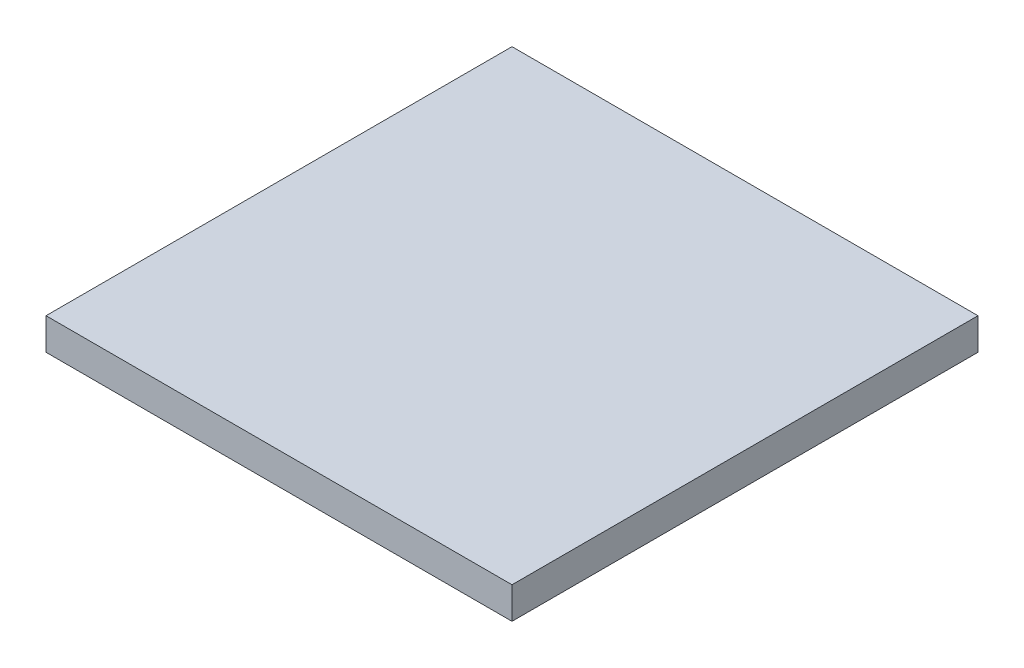
ISO-10303-21;
HEADER;
FILE_DESCRIPTION(('STEP AP214'),'2;1');
FILE_NAME('part.step','',(''),(''),'','','');
FILE_SCHEMA(('AUTOMOTIVE_DESIGN { 1 0 10303 214 1 1 1 1 }'));
ENDSEC;
DATA;
#1=APPLICATION_CONTEXT('core data for automotive mechanical design processes');
#2=APPLICATION_PROTOCOL_DEFINITION('international standard','automotive_design',2000,#1);
#3=PRODUCT_CONTEXT('',#1,'mechanical');
#4=PRODUCT('Part','Part','',(#3));
#5=PRODUCT_RELATED_PRODUCT_CATEGORY('part','',(#4));
#6=PRODUCT_DEFINITION_FORMATION('','',#4);
#7=PRODUCT_DEFINITION_CONTEXT('part definition',#1,'design');
#8=PRODUCT_DEFINITION('design','',#6,#7);
#9=PRODUCT_DEFINITION_SHAPE('','',#8);
#10=(LENGTH_UNIT() NAMED_UNIT(*) SI_UNIT(.MILLI.,.METRE.));
#11=(NAMED_UNIT(*) PLANE_ANGLE_UNIT() SI_UNIT($,.RADIAN.));
#12=(NAMED_UNIT(*) SI_UNIT($,.STERADIAN.) SOLID_ANGLE_UNIT());
#13=UNCERTAINTY_MEASURE_WITH_UNIT(LENGTH_MEASURE(1.E-05),#10,'distance_accuracy_value','');
#14=(GEOMETRIC_REPRESENTATION_CONTEXT(3) GLOBAL_UNCERTAINTY_ASSIGNED_CONTEXT((#13)) GLOBAL_UNIT_ASSIGNED_CONTEXT((#10,
#11,#12)) REPRESENTATION_CONTEXT('',''));
#15=CARTESIAN_POINT('',(0.,0.,0.));
#16=DIRECTION('',(0.,0.,1.));
#17=DIRECTION('',(1.,0.,0.));
#18=AXIS2_PLACEMENT_3D('',#15,#16,#17);
#19=CARTESIAN_POINT('',(0.,0.,0.));
#20=DIRECTION('',(0.,1.,0.));
#21=DIRECTION('',(1.,0.,0.));
#22=AXIS2_PLACEMENT_3D('',#19,#20,#21);
#23=PLANE('',#22);
#24=DIRECTION('',(-1.,0.,0.));
#25=VECTOR('',#24,1.);
#26=CARTESIAN_POINT('',(5.,0.,-5.));
#27=LINE('',#26,#25);
#28=CARTESIAN_POINT('',(5.,0.,-5.));
#29=VERTEX_POINT('',#28);
#30=CARTESIAN_POINT('',(-5.,0.,-5.));
#31=VERTEX_POINT('',#30);
#32=EDGE_CURVE('E11',#29,#31,#27,.T.);
#33=ORIENTED_EDGE('',*,*,#32,.F.);
#34=DIRECTION('',(0.,0.,-1.));
#35=VECTOR('',#34,1.);
#36=CARTESIAN_POINT('',(5.,0.,5.));
#37=LINE('',#36,#35);
#38=CARTESIAN_POINT('',(5.,0.,5.));
#39=VERTEX_POINT('',#38);
#40=EDGE_CURVE('E24',#39,#29,#37,.T.);
#41=ORIENTED_EDGE('',*,*,#40,.F.);
#42=DIRECTION('',(1.,0.,0.));
#43=VECTOR('',#42,1.);
#44=CARTESIAN_POINT('',(-5.,0.,5.));
#45=LINE('',#44,#43);
#46=CARTESIAN_POINT('',(-5.,0.,5.));
#47=VERTEX_POINT('',#46);
#48=EDGE_CURVE('E61',#47,#39,#45,.T.);
#49=ORIENTED_EDGE('',*,*,#48,.F.);
#50=DIRECTION('',(0.,0.,1.));
#51=VECTOR('',#50,1.);
#52=CARTESIAN_POINT('',(-5.,0.,-5.));
#53=LINE('',#52,#51);
#54=EDGE_CURVE('E37',#31,#47,#53,.T.);
#55=ORIENTED_EDGE('',*,*,#54,.F.);
#56=EDGE_LOOP('',(#33,#41,#49,#55));
#57=FACE_BOUND('',#56,.T.);
#58=ADVANCED_FACE('F17',(#57),#23,.F.);
#59=CARTESIAN_POINT('',(-5.,0.,-5.));
#60=DIRECTION('',(-1.,0.,0.));
#61=DIRECTION('',(0.,0.,1.));
#62=AXIS2_PLACEMENT_3D('',#59,#60,#61);
#63=PLANE('',#62);
#64=DIRECTION('',(0.,1.,0.));
#65=VECTOR('',#64,1.);
#66=CARTESIAN_POINT('',(-5.,0.,5.));
#67=LINE('',#66,#65);
#68=CARTESIAN_POINT('',(-5.,0.68,5.));
#69=VERTEX_POINT('',#68);
#70=EDGE_CURVE('E84',#47,#69,#67,.T.);
#71=ORIENTED_EDGE('',*,*,#70,.T.);
#72=DIRECTION('',(0.,0.,1.));
#73=VECTOR('',#72,1.);
#74=CARTESIAN_POINT('',(-5.,0.68,-5.));
#75=LINE('',#74,#73);
#76=CARTESIAN_POINT('',(-5.,0.68,-5.));
#77=VERTEX_POINT('',#76);
#78=EDGE_CURVE('E74',#77,#69,#75,.T.);
#79=ORIENTED_EDGE('',*,*,#78,.F.);
#80=DIRECTION('',(0.,1.,0.));
#81=VECTOR('',#80,1.);
#82=CARTESIAN_POINT('',(-5.,0.,-5.));
#83=LINE('',#82,#81);
#84=EDGE_CURVE('E81',#31,#77,#83,.T.);
#85=ORIENTED_EDGE('',*,*,#84,.F.);
#86=ORIENTED_EDGE('',*,*,#54,.T.);
#87=EDGE_LOOP('',(#71,#79,#85,#86));
#88=FACE_BOUND('',#87,.T.);
#89=ADVANCED_FACE('F89',(#88),#63,.T.);
#90=CARTESIAN_POINT('',(5.,0.,-5.));
#91=DIRECTION('',(0.,0.,-1.));
#92=DIRECTION('',(-1.,0.,0.));
#93=AXIS2_PLACEMENT_3D('',#90,#91,#92);
#94=PLANE('',#93);
#95=ORIENTED_EDGE('',*,*,#84,.T.);
#96=DIRECTION('',(-1.,0.,0.));
#97=VECTOR('',#96,1.);
#98=CARTESIAN_POINT('',(5.,0.68,-5.));
#99=LINE('',#98,#97);
#100=CARTESIAN_POINT('',(5.,0.68,-5.));
#101=VERTEX_POINT('',#100);
#102=EDGE_CURVE('E79',#101,#77,#99,.T.);
#103=ORIENTED_EDGE('',*,*,#102,.F.);
#104=DIRECTION('',(0.,1.,0.));
#105=VECTOR('',#104,1.);
#106=CARTESIAN_POINT('',(5.,0.,-5.));
#107=LINE('',#106,#105);
#108=EDGE_CURVE('E67',#29,#101,#107,.T.);
#109=ORIENTED_EDGE('',*,*,#108,.F.);
#110=ORIENTED_EDGE('',*,*,#32,.T.);
#111=EDGE_LOOP('',(#95,#103,#109,#110));
#112=FACE_BOUND('',#111,.T.);
#113=ADVANCED_FACE('F91',(#112),#94,.T.);
#114=CARTESIAN_POINT('',(5.,0.,5.));
#115=DIRECTION('',(1.,0.,0.));
#116=DIRECTION('',(0.,0.,-1.));
#117=AXIS2_PLACEMENT_3D('',#114,#115,#116);
#118=PLANE('',#117);
#119=ORIENTED_EDGE('',*,*,#108,.T.);
#120=DIRECTION('',(0.,0.,-1.));
#121=VECTOR('',#120,1.);
#122=CARTESIAN_POINT('',(5.,0.68,5.));
#123=LINE('',#122,#121);
#124=CARTESIAN_POINT('',(5.,0.68,5.));
#125=VERTEX_POINT('',#124);
#126=EDGE_CURVE('E62',#125,#101,#123,.T.);
#127=ORIENTED_EDGE('',*,*,#126,.F.);
#128=DIRECTION('',(0.,1.,0.));
#129=VECTOR('',#128,1.);
#130=CARTESIAN_POINT('',(5.,0.,5.));
#131=LINE('',#130,#129);
#132=EDGE_CURVE('E55',#39,#125,#131,.T.);
#133=ORIENTED_EDGE('',*,*,#132,.F.);
#134=ORIENTED_EDGE('',*,*,#40,.T.);
#135=EDGE_LOOP('',(#119,#127,#133,#134));
#136=FACE_BOUND('',#135,.T.);
#137=ADVANCED_FACE('F65',(#136),#118,.T.);
#138=CARTESIAN_POINT('',(-5.,0.,5.));
#139=DIRECTION('',(0.,0.,1.));
#140=DIRECTION('',(1.,0.,0.));
#141=AXIS2_PLACEMENT_3D('',#138,#139,#140);
#142=PLANE('',#141);
#143=ORIENTED_EDGE('',*,*,#132,.T.);
#144=DIRECTION('',(1.,0.,0.));
#145=VECTOR('',#144,1.);
#146=CARTESIAN_POINT('',(-5.,0.68,5.));
#147=LINE('',#146,#145);
#148=EDGE_CURVE('E60',#69,#125,#147,.T.);
#149=ORIENTED_EDGE('',*,*,#148,.F.);
#150=ORIENTED_EDGE('',*,*,#70,.F.);
#151=ORIENTED_EDGE('',*,*,#48,.T.);
#152=EDGE_LOOP('',(#143,#149,#150,#151));
#153=FACE_BOUND('',#152,.T.);
#154=ADVANCED_FACE('F57',(#153),#142,.T.);
#155=CARTESIAN_POINT('',(0.,0.68,0.));
#156=DIRECTION('',(0.,1.,0.));
#157=DIRECTION('',(1.,0.,0.));
#158=AXIS2_PLACEMENT_3D('',#155,#156,#157);
#159=PLANE('',#158);
#160=ORIENTED_EDGE('',*,*,#148,.T.);
#161=ORIENTED_EDGE('',*,*,#126,.T.);
#162=ORIENTED_EDGE('',*,*,#102,.T.);
#163=ORIENTED_EDGE('',*,*,#78,.T.);
#164=EDGE_LOOP('',(#160,#161,#162,#163));
#165=FACE_BOUND('',#164,.T.);
#166=ADVANCED_FACE('F72',(#165),#159,.T.);
#167=CLOSED_SHELL('',(#58,#89,#113,#137,#154,#166));
#168=MANIFOLD_SOLID_BREP('B1',#167);
#169=ADVANCED_BREP_SHAPE_REPRESENTATION('',(#18,#168),#14);
#170=SHAPE_DEFINITION_REPRESENTATION(#9,#169);
ENDSEC;
END-ISO-10303-21;
